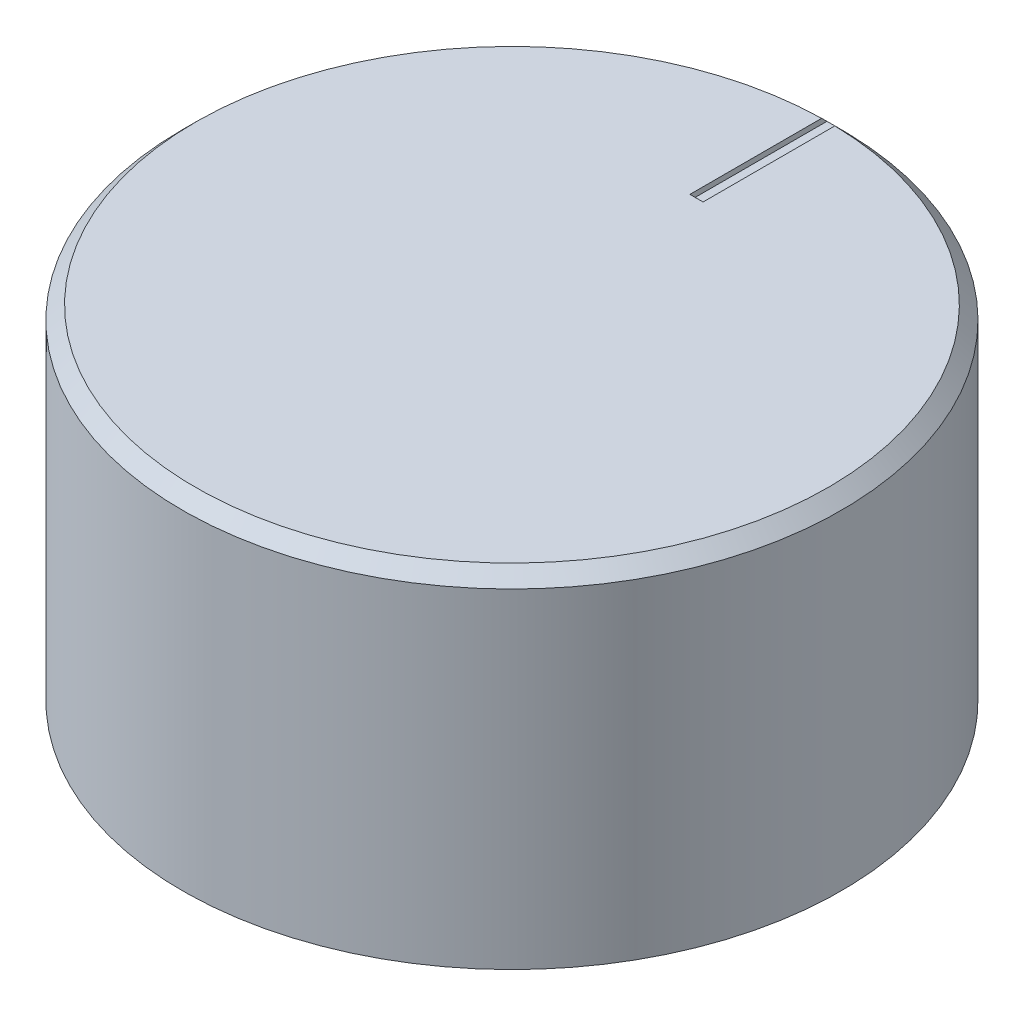
ISO-10303-21;
HEADER;
FILE_DESCRIPTION(('STEP AP214'),'2;1');
FILE_NAME('part.step','',(''),(''),'','','');
FILE_SCHEMA(('AUTOMOTIVE_DESIGN { 1 0 10303 214 1 1 1 1 }'));
ENDSEC;
DATA;
#1=APPLICATION_CONTEXT('core data for automotive mechanical design processes');
#2=APPLICATION_PROTOCOL_DEFINITION('international standard','automotive_design',2000,#1);
#3=PRODUCT_CONTEXT('',#1,'mechanical');
#4=PRODUCT('Part','Part','',(#3));
#5=PRODUCT_RELATED_PRODUCT_CATEGORY('part','',(#4));
#6=PRODUCT_DEFINITION_FORMATION('','',#4);
#7=PRODUCT_DEFINITION_CONTEXT('part definition',#1,'design');
#8=PRODUCT_DEFINITION('design','',#6,#7);
#9=PRODUCT_DEFINITION_SHAPE('','',#8);
#10=(LENGTH_UNIT() NAMED_UNIT(*) SI_UNIT(.MILLI.,.METRE.));
#11=(NAMED_UNIT(*) PLANE_ANGLE_UNIT() SI_UNIT($,.RADIAN.));
#12=(NAMED_UNIT(*) SI_UNIT($,.STERADIAN.) SOLID_ANGLE_UNIT());
#13=UNCERTAINTY_MEASURE_WITH_UNIT(LENGTH_MEASURE(1.E-05),#10,'distance_accuracy_value','');
#14=(GEOMETRIC_REPRESENTATION_CONTEXT(3) GLOBAL_UNCERTAINTY_ASSIGNED_CONTEXT((#13)) GLOBAL_UNIT_ASSIGNED_CONTEXT((#10,
#11,#12)) REPRESENTATION_CONTEXT('',''));
#15=CARTESIAN_POINT('',(0.,0.,0.));
#16=DIRECTION('',(0.,0.,1.));
#17=DIRECTION('',(1.,0.,0.));
#18=AXIS2_PLACEMENT_3D('',#15,#16,#17);
#19=CARTESIAN_POINT('',(0.,12.8,0.));
#20=DIRECTION('',(0.,-1.,0.));
#21=DIRECTION('',(0.,0.,-1.));
#22=AXIS2_PLACEMENT_3D('',#19,#20,#21);
#23=PLANE('',#22);
#24=DIRECTION('',(0.,0.,1.));
#25=VECTOR('',#24,1.);
#26=CARTESIAN_POINT('',(0.249999999999997,12.8,-13.0578940556669));
#27=LINE('',#26,#25);
#28=CARTESIAN_POINT('',(0.249999999999997,12.8,-12.1974382556338));
#29=VERTEX_POINT('',#28);
#30=CARTESIAN_POINT('',(0.249999999999998,12.8,-7.));
#31=VERTEX_POINT('',#30);
#32=EDGE_CURVE('E104',#29,#31,#27,.T.);
#33=ORIENTED_EDGE('',*,*,#32,.F.);
#34=CARTESIAN_POINT('',(0.,12.8,0.));
#35=DIRECTION('',(0.,-1.,0.));
#36=DIRECTION('',(0.,0.,-1.));
#37=AXIS2_PLACEMENT_3D('',#34,#35,#36);
#38=CIRCLE('',#37,12.2);
#39=CARTESIAN_POINT('',(-0.250000000000003,12.8,-12.1974382556338));
#40=VERTEX_POINT('',#39);
#41=EDGE_CURVE('E63',#29,#40,#38,.F.);
#42=ORIENTED_EDGE('',*,*,#41,.T.);
#43=DIRECTION('',(0.,0.,1.));
#44=VECTOR('',#43,1.);
#45=CARTESIAN_POINT('',(-0.250000000000003,12.8,-13.0578940556669));
#46=LINE('',#45,#44);
#47=CARTESIAN_POINT('',(-0.250000000000002,12.8,-7.));
#48=VERTEX_POINT('',#47);
#49=EDGE_CURVE('E146',#40,#48,#46,.T.);
#50=ORIENTED_EDGE('',*,*,#49,.T.);
#51=DIRECTION('',(1.,0.,0.));
#52=VECTOR('',#51,1.);
#53=CARTESIAN_POINT('',(-0.250000000000002,12.8,-7.));
#54=LINE('',#53,#52);
#55=EDGE_CURVE('E129',#48,#31,#54,.T.);
#56=ORIENTED_EDGE('',*,*,#55,.T.);
#57=EDGE_LOOP('',(#33,#42,#50,#56));
#58=FACE_BOUND('',#57,.T.);
#59=ADVANCED_FACE('F44',(#58),#23,.F.);
#60=CARTESIAN_POINT('',(0.,9.,0.));
#61=DIRECTION('',(0.,1.,0.));
#62=DIRECTION('',(-1.,0.,0.));
#63=AXIS2_PLACEMENT_3D('',#60,#61,#62);
#64=PLANE('',#63);
#65=CARTESIAN_POINT('',(0.,9.,0.));
#66=DIRECTION('',(0.,1.,0.));
#67=DIRECTION('',(-1.,0.,0.));
#68=AXIS2_PLACEMENT_3D('',#65,#66,#67);
#69=CIRCLE('',#68,2.5);
#70=CARTESIAN_POINT('',(-2.5,9.,0.));
#71=VERTEX_POINT('',#70);
#72=EDGE_CURVE('E106',#71,#71,#69,.F.);
#73=ORIENTED_EDGE('',*,*,#72,.T.);
#74=EDGE_LOOP('',(#73));
#75=FACE_BOUND('',#74,.T.);
#76=ADVANCED_FACE('F158',(#75),#64,.F.);
#77=CARTESIAN_POINT('',(-0.250000000000003,12.8,-13.0578940556669));
#78=DIRECTION('',(-1.,0.,0.));
#79=DIRECTION('',(0.,0.,1.));
#80=AXIS2_PLACEMENT_3D('',#77,#78,#79);
#81=PLANE('',#80);
#82=ORIENTED_EDGE('',*,*,#49,.F.);
#83=CARTESIAN_POINT('',(-0.250000000000003,12.8,-12.1974382556338));
#84=CARTESIAN_POINT('',(-0.250000000000003,13.4482690990723,-11.5490450974811));
#85=CARTESIAN_POINT('',(-0.250000000000003,14.0965192367073,-10.9006329837363));
#86=CARTESIAN_POINT('',(-0.250000000000003,15.3929815893128,-9.60377084485224));
#87=CARTESIAN_POINT('',(-0.250000000000003,16.0411938042832,-8.95532081971295));
#88=CARTESIAN_POINT('',(-0.250000000000003,16.6893870578163,-8.30685183898155));
#89=B_SPLINE_CURVE_WITH_KNOTS('',3,(#83,#84,#85,#86,#87,#88),.UNSPECIFIED.,.F.,.F.,(4,2,4),(0.,
2.75063603403886,5.50127206896976),.UNSPECIFIED.);
#90=CARTESIAN_POINT('',(-0.250000000000004,13.,-11.9973955507018));
#91=VERTEX_POINT('',#90);
#92=EDGE_CURVE('E53',#40,#91,#89,.T.);
#93=ORIENTED_EDGE('',*,*,#92,.T.);
#94=DIRECTION('',(0.,0.,1.));
#95=VECTOR('',#94,1.);
#96=CARTESIAN_POINT('',(-0.250000000000004,13.,0.));
#97=LINE('',#96,#95);
#98=CARTESIAN_POINT('',(-0.250000000000003,13.,-7.));
#99=VERTEX_POINT('',#98);
#100=EDGE_CURVE('E99',#91,#99,#97,.T.);
#101=ORIENTED_EDGE('',*,*,#100,.T.);
#102=DIRECTION('',(0.,1.,0.));
#103=VECTOR('',#102,1.);
#104=CARTESIAN_POINT('',(-0.250000000000002,12.8,-7.));
#105=LINE('',#104,#103);
#106=EDGE_CURVE('E94',#99,#48,#105,.F.);
#107=ORIENTED_EDGE('',*,*,#106,.T.);
#108=EDGE_LOOP('',(#82,#93,#101,#107));
#109=FACE_BOUND('',#108,.T.);
#110=ADVANCED_FACE('F153',(#109),#81,.F.);
#111=CARTESIAN_POINT('',(-0.250000000000002,12.8,-7.));
#112=DIRECTION('',(0.,0.,1.));
#113=DIRECTION('',(1.,0.,0.));
#114=AXIS2_PLACEMENT_3D('',#111,#112,#113);
#115=PLANE('',#114);
#116=DIRECTION('',(0.,1.,0.));
#117=VECTOR('',#116,1.);
#118=CARTESIAN_POINT('',(0.249999999999998,12.8,-7.));
#119=LINE('',#118,#117);
#120=CARTESIAN_POINT('',(0.249999999999997,13.,-7.));
#121=VERTEX_POINT('',#120);
#122=EDGE_CURVE('E92',#31,#121,#119,.T.);
#123=ORIENTED_EDGE('',*,*,#122,.F.);
#124=ORIENTED_EDGE('',*,*,#55,.F.);
#125=ORIENTED_EDGE('',*,*,#106,.F.);
#126=DIRECTION('',(1.,0.,0.));
#127=VECTOR('',#126,1.);
#128=CARTESIAN_POINT('',(12.5,13.,-7.));
#129=LINE('',#128,#127);
#130=EDGE_CURVE('E88',#99,#121,#129,.T.);
#131=ORIENTED_EDGE('',*,*,#130,.T.);
#132=EDGE_LOOP('',(#123,#124,#125,#131));
#133=FACE_BOUND('',#132,.T.);
#134=ADVANCED_FACE('F90',(#133),#115,.F.);
#135=CARTESIAN_POINT('',(0.249999999999997,12.8,-13.0578940556669));
#136=DIRECTION('',(-1.,0.,0.));
#137=DIRECTION('',(0.,0.,1.));
#138=AXIS2_PLACEMENT_3D('',#135,#136,#137);
#139=PLANE('',#138);
#140=DIRECTION('',(0.,0.,1.));
#141=VECTOR('',#140,1.);
#142=CARTESIAN_POINT('',(0.249999999999997,13.,0.));
#143=LINE('',#142,#141);
#144=CARTESIAN_POINT('',(0.249999999999997,13.,-11.9973955507018));
#145=VERTEX_POINT('',#144);
#146=EDGE_CURVE('E98',#121,#145,#143,.F.);
#147=ORIENTED_EDGE('',*,*,#146,.T.);
#148=CARTESIAN_POINT('',(0.249999999999997,13.,-11.9973955507018));
#149=CARTESIAN_POINT('',(0.249999999999997,12.3517368340844,-12.6457946380684));
#150=CARTESIAN_POINT('',(0.249999999999997,11.7034662555647,-13.2941863140457));
#151=CARTESIAN_POINT('',(0.249999999999997,10.4069102733406,-14.5909548431985));
#152=CARTESIAN_POINT('',(0.249999999999997,9.7586248696363,-15.239331696374));
#153=CARTESIAN_POINT('',(0.249999999999997,9.11033205332788,-15.8877011381603));
#154=B_SPLINE_CURVE_WITH_KNOTS('',3,(#148,#149,#150,#151,#152,#153),.UNSPECIFIED.,.F.,.F.,(4,2,
4),(0.,2.75063603118614,5.501272062272),.UNSPECIFIED.);
#155=EDGE_CURVE('E126',#145,#29,#154,.T.);
#156=ORIENTED_EDGE('',*,*,#155,.T.);
#157=ORIENTED_EDGE('',*,*,#32,.T.);
#158=ORIENTED_EDGE('',*,*,#122,.T.);
#159=EDGE_LOOP('',(#147,#156,#157,#158));
#160=FACE_BOUND('',#159,.T.);
#161=ADVANCED_FACE('F103',(#160),#139,.T.);
#162=CARTESIAN_POINT('',(0.,13.,0.));
#163=DIRECTION('',(0.,1.,0.));
#164=DIRECTION('',(-1.,0.,0.));
#165=AXIS2_PLACEMENT_3D('',#162,#163,#164);
#166=CYLINDRICAL_SURFACE('',#165,2.5);
#167=ORIENTED_EDGE('',*,*,#72,.F.);
#168=EDGE_LOOP('',(#167));
#169=FACE_BOUND('',#168,.T.);
#170=CARTESIAN_POINT('',(0.,0.,0.));
#171=DIRECTION('',(0.,1.,0.));
#172=DIRECTION('',(-1.,0.,0.));
#173=AXIS2_PLACEMENT_3D('',#170,#171,#172);
#174=CIRCLE('',#173,2.5);
#175=CARTESIAN_POINT('',(-2.5,0.,0.));
#176=VERTEX_POINT('',#175);
#177=EDGE_CURVE('E112',#176,#176,#174,.F.);
#178=ORIENTED_EDGE('',*,*,#177,.T.);
#179=EDGE_LOOP('',(#178));
#180=FACE_BOUND('',#179,.T.);
#181=ADVANCED_FACE('F180',(#169,#180),#166,.F.);
#182=CARTESIAN_POINT('',(12.5,13.,0.));
#183=DIRECTION('',(0.,-1.,0.));
#184=DIRECTION('',(1.,0.,0.));
#185=AXIS2_PLACEMENT_3D('',#182,#183,#184);
#186=PLANE('',#185);
#187=ORIENTED_EDGE('',*,*,#100,.F.);
#188=CARTESIAN_POINT('',(0.,13.,0.));
#189=DIRECTION('',(0.,-1.,0.));
#190=DIRECTION('',(1.,0.,0.));
#191=AXIS2_PLACEMENT_3D('',#188,#189,#190);
#192=CIRCLE('',#191,12.);
#193=EDGE_CURVE('E111',#91,#145,#192,.F.);
#194=ORIENTED_EDGE('',*,*,#193,.T.);
#195=ORIENTED_EDGE('',*,*,#146,.F.);
#196=ORIENTED_EDGE('',*,*,#130,.F.);
#197=EDGE_LOOP('',(#187,#194,#195,#196));
#198=FACE_BOUND('',#197,.T.);
#199=ADVANCED_FACE('F109',(#198),#186,.F.);
#200=CARTESIAN_POINT('',(2.5,0.,0.));
#201=DIRECTION('',(0.,1.,0.));
#202=DIRECTION('',(-1.,0.,0.));
#203=AXIS2_PLACEMENT_3D('',#200,#201,#202);
#204=PLANE('',#203);
#205=ORIENTED_EDGE('',*,*,#177,.F.);
#206=EDGE_LOOP('',(#205));
#207=FACE_BOUND('',#206,.T.);
#208=CARTESIAN_POINT('',(0.,0.,0.));
#209=DIRECTION('',(0.,1.,0.));
#210=DIRECTION('',(-1.,0.,0.));
#211=AXIS2_PLACEMENT_3D('',#208,#209,#210);
#212=CIRCLE('',#211,12.5);
#213=CARTESIAN_POINT('',(-12.5,0.,0.));
#214=VERTEX_POINT('',#213);
#215=EDGE_CURVE('E115',#214,#214,#212,.T.);
#216=ORIENTED_EDGE('',*,*,#215,.F.);
#217=EDGE_LOOP('',(#216));
#218=FACE_BOUND('',#217,.T.);
#219=ADVANCED_FACE('F168',(#207,#218),#204,.F.);
#220=CARTESIAN_POINT('',(0.,13.,0.));
#221=DIRECTION('',(0.,1.,0.));
#222=DIRECTION('',(-1.,0.,0.));
#223=AXIS2_PLACEMENT_3D('',#220,#221,#222);
#224=CYLINDRICAL_SURFACE('',#223,12.5);
#225=CARTESIAN_POINT('',(0.,12.5,0.));
#226=DIRECTION('',(0.,-1.,0.));
#227=DIRECTION('',(1.,0.,0.));
#228=AXIS2_PLACEMENT_3D('',#225,#226,#227);
#229=CIRCLE('',#228,12.5);
#230=CARTESIAN_POINT('',(-0.26041666666667,12.5,-12.4972870319811));
#231=VERTEX_POINT('',#230);
#232=EDGE_CURVE('E11',#231,#231,#229,.T.);
#233=ORIENTED_EDGE('',*,*,#232,.T.);
#234=EDGE_LOOP('',(#233));
#235=FACE_BOUND('',#234,.T.);
#236=ORIENTED_EDGE('',*,*,#215,.T.);
#237=EDGE_LOOP('',(#236));
#238=FACE_BOUND('',#237,.T.);
#239=ADVANCED_FACE('F166',(#235,#238),#224,.T.);
#240=CARTESIAN_POINT('',(0.,13.,0.));
#241=DIRECTION('',(0.,-1.,0.));
#242=DIRECTION('',(1.,0.,0.));
#243=AXIS2_PLACEMENT_3D('',#240,#241,#242);
#244=CONICAL_SURFACE('',#243,12.,0.785398163397448);
#245=ORIENTED_EDGE('',*,*,#232,.F.);
#246=EDGE_LOOP('',(#245));
#247=FACE_BOUND('',#246,.T.);
#248=ORIENTED_EDGE('',*,*,#155,.F.);
#249=ORIENTED_EDGE('',*,*,#193,.F.);
#250=ORIENTED_EDGE('',*,*,#92,.F.);
#251=ORIENTED_EDGE('',*,*,#41,.F.);
#252=EDGE_LOOP('',(#248,#249,#250,#251));
#253=FACE_BOUND('',#252,.T.);
#254=ADVANCED_FACE('F46',(#247,#253),#244,.T.);
#255=CLOSED_SHELL('',(#59,#76,#110,#134,#161,#181,#199,#219,#239,#254));
#256=MANIFOLD_SOLID_BREP('B2',#255);
#257=ADVANCED_BREP_SHAPE_REPRESENTATION('',(#18,#256),#14);
#258=SHAPE_DEFINITION_REPRESENTATION(#9,#257);
ENDSEC;
END-ISO-10303-21;
